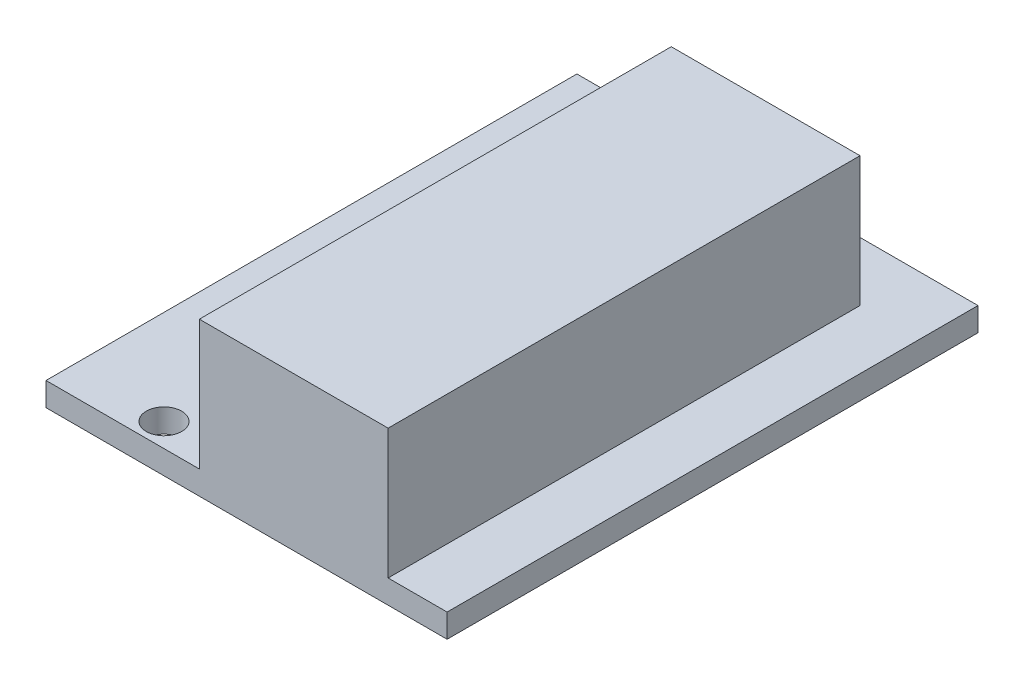
ISO-10303-21;
HEADER;
FILE_DESCRIPTION(('STEP AP214'),'2;1');
FILE_NAME('part.step','',(''),(''),'','','');
FILE_SCHEMA(('AUTOMOTIVE_DESIGN { 1 0 10303 214 1 1 1 1 }'));
ENDSEC;
DATA;
#1=APPLICATION_CONTEXT('core data for automotive mechanical design processes');
#2=APPLICATION_PROTOCOL_DEFINITION('international standard','automotive_design',2000,#1);
#3=PRODUCT_CONTEXT('',#1,'mechanical');
#4=PRODUCT('Part','Part','',(#3));
#5=PRODUCT_RELATED_PRODUCT_CATEGORY('part','',(#4));
#6=PRODUCT_DEFINITION_FORMATION('','',#4);
#7=PRODUCT_DEFINITION_CONTEXT('part definition',#1,'design');
#8=PRODUCT_DEFINITION('design','',#6,#7);
#9=PRODUCT_DEFINITION_SHAPE('','',#8);
#10=(LENGTH_UNIT() NAMED_UNIT(*) SI_UNIT(.MILLI.,.METRE.));
#11=(NAMED_UNIT(*) PLANE_ANGLE_UNIT() SI_UNIT($,.RADIAN.));
#12=(NAMED_UNIT(*) SI_UNIT($,.STERADIAN.) SOLID_ANGLE_UNIT());
#13=UNCERTAINTY_MEASURE_WITH_UNIT(LENGTH_MEASURE(1.E-05),#10,'distance_accuracy_value','');
#14=(GEOMETRIC_REPRESENTATION_CONTEXT(3) GLOBAL_UNCERTAINTY_ASSIGNED_CONTEXT((#13)) GLOBAL_UNIT_ASSIGNED_CONTEXT((#10,
#11,#12)) REPRESENTATION_CONTEXT('',''));
#15=CARTESIAN_POINT('',(0.,0.,0.));
#16=DIRECTION('',(0.,0.,1.));
#17=DIRECTION('',(1.,0.,0.));
#18=AXIS2_PLACEMENT_3D('',#15,#16,#17);
#19=CARTESIAN_POINT('',(12.,13.,-11.));
#20=DIRECTION('',(0.,0.,-1.));
#21=DIRECTION('',(-1.,0.,0.));
#22=AXIS2_PLACEMENT_3D('',#19,#20,#21);
#23=PLANE('',#22);
#24=DIRECTION('',(0.,-1.,0.));
#25=VECTOR('',#24,1.);
#26=CARTESIAN_POINT('',(-4.,13.,-11.));
#27=LINE('',#26,#25);
#28=CARTESIAN_POINT('',(-4.,13.,-11.));
#29=VERTEX_POINT('',#28);
#30=CARTESIAN_POINT('',(-4.,2.,-11.));
#31=VERTEX_POINT('',#30);
#32=EDGE_CURVE('E174',#29,#31,#27,.T.);
#33=ORIENTED_EDGE('',*,*,#32,.T.);
#34=DIRECTION('',(1.,0.,0.));
#35=VECTOR('',#34,1.);
#36=CARTESIAN_POINT('',(0.,2.,-11.));
#37=LINE('',#36,#35);
#38=CARTESIAN_POINT('',(-17.,2.,-11.));
#39=VERTEX_POINT('',#38);
#40=EDGE_CURVE('E43',#39,#31,#37,.T.);
#41=ORIENTED_EDGE('',*,*,#40,.F.);
#42=DIRECTION('',(0.,1.,0.));
#43=VECTOR('',#42,1.);
#44=CARTESIAN_POINT('',(-17.,2.,-11.));
#45=LINE('',#44,#43);
#46=CARTESIAN_POINT('',(-17.,0.,-11.));
#47=VERTEX_POINT('',#46);
#48=EDGE_CURVE('E220',#47,#39,#45,.T.);
#49=ORIENTED_EDGE('',*,*,#48,.F.);
#50=DIRECTION('',(1.,0.,0.));
#51=VECTOR('',#50,1.);
#52=CARTESIAN_POINT('',(0.,0.,-11.));
#53=LINE('',#52,#51);
#54=CARTESIAN_POINT('',(17.,0.,-11.));
#55=VERTEX_POINT('',#54);
#56=EDGE_CURVE('E11',#47,#55,#53,.T.);
#57=ORIENTED_EDGE('',*,*,#56,.T.);
#58=DIRECTION('',(0.,-1.,0.));
#59=VECTOR('',#58,1.);
#60=CARTESIAN_POINT('',(17.,2.,-11.));
#61=LINE('',#60,#59);
#62=CARTESIAN_POINT('',(17.,2.,-11.));
#63=VERTEX_POINT('',#62);
#64=EDGE_CURVE('E57',#63,#55,#61,.T.);
#65=ORIENTED_EDGE('',*,*,#64,.F.);
#66=CARTESIAN_POINT('',(12.,2.,-11.));
#67=VERTEX_POINT('',#66);
#68=EDGE_CURVE('E50',#67,#63,#37,.T.);
#69=ORIENTED_EDGE('',*,*,#68,.F.);
#70=DIRECTION('',(0.,-1.,0.));
#71=VECTOR('',#70,1.);
#72=CARTESIAN_POINT('',(12.,13.,-11.));
#73=LINE('',#72,#71);
#74=CARTESIAN_POINT('',(12.,13.,-11.));
#75=VERTEX_POINT('',#74);
#76=EDGE_CURVE('E165',#75,#67,#73,.T.);
#77=ORIENTED_EDGE('',*,*,#76,.F.);
#78=DIRECTION('',(1.,0.,0.));
#79=VECTOR('',#78,1.);
#80=CARTESIAN_POINT('',(12.,13.,-11.));
#81=LINE('',#80,#79);
#82=EDGE_CURVE('E164',#29,#75,#81,.T.);
#83=ORIENTED_EDGE('',*,*,#82,.F.);
#84=EDGE_LOOP('',(#33,#41,#49,#57,#65,#69,#77,#83));
#85=FACE_BOUND('',#84,.T.);
#86=ADVANCED_FACE('F35',(#85),#23,.F.);
#87=CARTESIAN_POINT('',(-7.00000000000001,10.,-36.));
#88=DIRECTION('',(1.,0.,0.));
#89=DIRECTION('',(0.,0.,-1.));
#90=AXIS2_PLACEMENT_3D('',#87,#88,#89);
#91=PLANE('',#90);
#92=DIRECTION('',(0.,0.,1.));
#93=VECTOR('',#92,1.);
#94=CARTESIAN_POINT('',(-7.00000000000001,2.,-36.));
#95=LINE('',#94,#93);
#96=CARTESIAN_POINT('',(-7.00000000000001,2.,-36.));
#97=VERTEX_POINT('',#96);
#98=CARTESIAN_POINT('',(-7.00000000000001,2.,-16.));
#99=VERTEX_POINT('',#98);
#100=EDGE_CURVE('E145',#97,#99,#95,.T.);
#101=ORIENTED_EDGE('',*,*,#100,.T.);
#102=DIRECTION('',(0.,-1.,0.));
#103=VECTOR('',#102,1.);
#104=CARTESIAN_POINT('',(-7.00000000000001,10.,-16.));
#105=LINE('',#104,#103);
#106=CARTESIAN_POINT('',(-7.00000000000001,10.,-16.));
#107=VERTEX_POINT('',#106);
#108=EDGE_CURVE('E126',#107,#99,#105,.T.);
#109=ORIENTED_EDGE('',*,*,#108,.F.);
#110=DIRECTION('',(0.,0.,1.));
#111=VECTOR('',#110,1.);
#112=CARTESIAN_POINT('',(-7.00000000000001,10.,-36.));
#113=LINE('',#112,#111);
#114=CARTESIAN_POINT('',(-7.00000000000001,10.,-36.));
#115=VERTEX_POINT('',#114);
#116=EDGE_CURVE('E133',#115,#107,#113,.T.);
#117=ORIENTED_EDGE('',*,*,#116,.F.);
#118=DIRECTION('',(0.,-1.,0.));
#119=VECTOR('',#118,1.);
#120=CARTESIAN_POINT('',(-7.00000000000001,10.,-36.));
#121=LINE('',#120,#119);
#122=EDGE_CURVE('E148',#115,#97,#121,.T.);
#123=ORIENTED_EDGE('',*,*,#122,.T.);
#124=EDGE_LOOP('',(#101,#109,#117,#123));
#125=FACE_BOUND('',#124,.T.);
#126=ADVANCED_FACE('F143',(#125),#91,.F.);
#127=CARTESIAN_POINT('',(-9.00000000000001,2.,-13.));
#128=DIRECTION('',(0.,-1.,0.));
#129=DIRECTION('',(0.,0.,-1.));
#130=AXIS2_PLACEMENT_3D('',#127,#128,#129);
#131=CYLINDRICAL_SURFACE('',#130,1.5);
#132=CARTESIAN_POINT('',(-9.00000000000001,2.,-13.));
#133=DIRECTION('',(0.,1.,0.));
#134=DIRECTION('',(0.,0.,1.));
#135=AXIS2_PLACEMENT_3D('',#132,#133,#134);
#136=CIRCLE('',#135,1.5);
#137=CARTESIAN_POINT('',(-9.00000000000001,2.,-11.5));
#138=VERTEX_POINT('',#137);
#139=EDGE_CURVE('E184',#138,#138,#136,.T.);
#140=ORIENTED_EDGE('',*,*,#139,.T.);
#141=EDGE_LOOP('',(#140));
#142=FACE_BOUND('',#141,.T.);
#143=CARTESIAN_POINT('',(-9.00000000000001,0.,-13.));
#144=DIRECTION('',(0.,1.,0.));
#145=DIRECTION('',(0.,0.,1.));
#146=AXIS2_PLACEMENT_3D('',#143,#144,#145);
#147=CIRCLE('',#146,1.5);
#148=CARTESIAN_POINT('',(-9.00000000000001,0.,-11.5));
#149=VERTEX_POINT('',#148);
#150=EDGE_CURVE('E183',#149,#149,#147,.T.);
#151=ORIENTED_EDGE('',*,*,#150,.F.);
#152=EDGE_LOOP('',(#151));
#153=FACE_BOUND('',#152,.T.);
#154=ADVANCED_FACE('F266',(#142,#153),#131,.F.);
#155=CARTESIAN_POINT('',(-9.00000000000001,2.,-49.));
#156=DIRECTION('',(0.,-1.,0.));
#157=DIRECTION('',(0.,0.,-1.));
#158=AXIS2_PLACEMENT_3D('',#155,#156,#157);
#159=CYLINDRICAL_SURFACE('',#158,1.5);
#160=CARTESIAN_POINT('',(-9.00000000000001,2.,-49.));
#161=DIRECTION('',(0.,1.,0.));
#162=DIRECTION('',(0.,0.,1.));
#163=AXIS2_PLACEMENT_3D('',#160,#161,#162);
#164=CIRCLE('',#163,1.5);
#165=CARTESIAN_POINT('',(-9.00000000000001,2.,-47.5));
#166=VERTEX_POINT('',#165);
#167=EDGE_CURVE('E190',#166,#166,#164,.T.);
#168=ORIENTED_EDGE('',*,*,#167,.T.);
#169=EDGE_LOOP('',(#168));
#170=FACE_BOUND('',#169,.T.);
#171=CARTESIAN_POINT('',(-9.00000000000001,0.,-49.));
#172=DIRECTION('',(0.,1.,0.));
#173=DIRECTION('',(0.,0.,1.));
#174=AXIS2_PLACEMENT_3D('',#171,#172,#173);
#175=CIRCLE('',#174,1.5);
#176=CARTESIAN_POINT('',(-9.00000000000001,0.,-47.5));
#177=VERTEX_POINT('',#176);
#178=EDGE_CURVE('E187',#177,#177,#175,.T.);
#179=ORIENTED_EDGE('',*,*,#178,.F.);
#180=EDGE_LOOP('',(#179));
#181=FACE_BOUND('',#180,.T.);
#182=ADVANCED_FACE('F294',(#170,#181),#159,.F.);
#183=CARTESIAN_POINT('',(-17.,2.,-56.));
#184=DIRECTION('',(0.,0.,1.));
#185=DIRECTION('',(1.,0.,0.));
#186=AXIS2_PLACEMENT_3D('',#183,#184,#185);
#187=PLANE('',#186);
#188=DIRECTION('',(-1.,0.,0.));
#189=VECTOR('',#188,1.);
#190=CARTESIAN_POINT('',(-17.,0.,-56.));
#191=LINE('',#190,#189);
#192=CARTESIAN_POINT('',(17.,0.,-56.));
#193=VERTEX_POINT('',#192);
#194=CARTESIAN_POINT('',(-17.,0.,-56.));
#195=VERTEX_POINT('',#194);
#196=EDGE_CURVE('E206',#193,#195,#191,.T.);
#197=ORIENTED_EDGE('',*,*,#196,.T.);
#198=DIRECTION('',(0.,-1.,0.));
#199=VECTOR('',#198,1.);
#200=CARTESIAN_POINT('',(-17.,2.,-56.));
#201=LINE('',#200,#199);
#202=CARTESIAN_POINT('',(-17.,2.,-56.));
#203=VERTEX_POINT('',#202);
#204=EDGE_CURVE('E204',#203,#195,#201,.T.);
#205=ORIENTED_EDGE('',*,*,#204,.F.);
#206=DIRECTION('',(-1.,0.,0.));
#207=VECTOR('',#206,1.);
#208=CARTESIAN_POINT('',(-17.,2.,-56.));
#209=LINE('',#208,#207);
#210=CARTESIAN_POINT('',(17.,2.,-56.));
#211=VERTEX_POINT('',#210);
#212=EDGE_CURVE('E198',#211,#203,#209,.T.);
#213=ORIENTED_EDGE('',*,*,#212,.F.);
#214=DIRECTION('',(0.,-1.,0.));
#215=VECTOR('',#214,1.);
#216=CARTESIAN_POINT('',(17.,2.,-56.));
#217=LINE('',#216,#215);
#218=EDGE_CURVE('E212',#211,#193,#217,.T.);
#219=ORIENTED_EDGE('',*,*,#218,.T.);
#220=EDGE_LOOP('',(#197,#205,#213,#219));
#221=FACE_BOUND('',#220,.T.);
#222=ADVANCED_FACE('F258',(#221),#187,.F.);
#223=CARTESIAN_POINT('',(0.,10.,0.));
#224=DIRECTION('',(0.,1.,0.));
#225=DIRECTION('',(0.,0.,1.));
#226=AXIS2_PLACEMENT_3D('',#223,#224,#225);
#227=PLANE('',#226);
#228=DIRECTION('',(0.,0.,1.));
#229=VECTOR('',#228,1.);
#230=CARTESIAN_POINT('',(-4.00000000000001,10.,-51.));
#231=LINE('',#230,#229);
#232=CARTESIAN_POINT('',(-4.,10.,-36.));
#233=VERTEX_POINT('',#232);
#234=CARTESIAN_POINT('',(-4.,10.,-16.));
#235=VERTEX_POINT('',#234);
#236=EDGE_CURVE('E215',#233,#235,#231,.T.);
#237=ORIENTED_EDGE('',*,*,#236,.F.);
#238=DIRECTION('',(-1.,0.,0.));
#239=VECTOR('',#238,1.);
#240=CARTESIAN_POINT('',(-7.00000000000001,10.,-36.));
#241=LINE('',#240,#239);
#242=EDGE_CURVE('E132',#233,#115,#241,.T.);
#243=ORIENTED_EDGE('',*,*,#242,.T.);
#244=ORIENTED_EDGE('',*,*,#116,.T.);
#245=DIRECTION('',(1.,0.,0.));
#246=VECTOR('',#245,1.);
#247=CARTESIAN_POINT('',(-7.00000000000001,10.,-16.));
#248=LINE('',#247,#246);
#249=EDGE_CURVE('E122',#107,#235,#248,.T.);
#250=ORIENTED_EDGE('',*,*,#249,.T.);
#251=EDGE_LOOP('',(#237,#243,#244,#250));
#252=FACE_BOUND('',#251,.T.);
#253=ADVANCED_FACE('F136',(#252),#227,.T.);
#254=CARTESIAN_POINT('',(-7.00000000000001,10.,-36.));
#255=DIRECTION('',(0.,0.,1.));
#256=DIRECTION('',(1.,0.,0.));
#257=AXIS2_PLACEMENT_3D('',#254,#255,#256);
#258=PLANE('',#257);
#259=ORIENTED_EDGE('',*,*,#242,.F.);
#260=DIRECTION('',(0.,-1.,0.));
#261=VECTOR('',#260,1.);
#262=CARTESIAN_POINT('',(-4.00000000000001,13.,-36.));
#263=LINE('',#262,#261);
#264=CARTESIAN_POINT('',(-4.,2.,-36.));
#265=VERTEX_POINT('',#264);
#266=EDGE_CURVE('E217',#233,#265,#263,.T.);
#267=ORIENTED_EDGE('',*,*,#266,.T.);
#268=DIRECTION('',(-1.,0.,0.));
#269=VECTOR('',#268,1.);
#270=CARTESIAN_POINT('',(-7.00000000000001,2.,-36.));
#271=LINE('',#270,#269);
#272=EDGE_CURVE('E141',#265,#97,#271,.T.);
#273=ORIENTED_EDGE('',*,*,#272,.T.);
#274=ORIENTED_EDGE('',*,*,#122,.F.);
#275=EDGE_LOOP('',(#259,#267,#273,#274));
#276=FACE_BOUND('',#275,.T.);
#277=ADVANCED_FACE('F249',(#276),#258,.F.);
#278=CARTESIAN_POINT('',(0.,2.,0.));
#279=DIRECTION('',(0.,-1.,0.));
#280=DIRECTION('',(0.,0.,-1.));
#281=AXIS2_PLACEMENT_3D('',#278,#279,#280);
#282=PLANE('',#281);
#283=ORIENTED_EDGE('',*,*,#139,.F.);
#284=EDGE_LOOP('',(#283));
#285=FACE_BOUND('',#284,.T.);
#286=ORIENTED_EDGE('',*,*,#167,.F.);
#287=EDGE_LOOP('',(#286));
#288=FACE_BOUND('',#287,.T.);
#289=DIRECTION('',(0.,0.,1.));
#290=VECTOR('',#289,1.);
#291=CARTESIAN_POINT('',(-17.,2.,56.));
#292=LINE('',#291,#290);
#293=EDGE_CURVE('E201',#203,#39,#292,.T.);
#294=ORIENTED_EDGE('',*,*,#293,.T.);
#295=ORIENTED_EDGE('',*,*,#40,.T.);
#296=DIRECTION('',(0.,0.,1.));
#297=VECTOR('',#296,1.);
#298=CARTESIAN_POINT('',(-4.00000000000001,2.,-51.));
#299=LINE('',#298,#297);
#300=CARTESIAN_POINT('',(-4.,2.,-16.));
#301=VERTEX_POINT('',#300);
#302=EDGE_CURVE('E169',#301,#31,#299,.T.);
#303=ORIENTED_EDGE('',*,*,#302,.F.);
#304=DIRECTION('',(1.,0.,0.));
#305=VECTOR('',#304,1.);
#306=CARTESIAN_POINT('',(-7.00000000000001,2.,-16.));
#307=LINE('',#306,#305);
#308=EDGE_CURVE('E245',#99,#301,#307,.T.);
#309=ORIENTED_EDGE('',*,*,#308,.F.);
#310=ORIENTED_EDGE('',*,*,#100,.F.);
#311=ORIENTED_EDGE('',*,*,#272,.F.);
#312=CARTESIAN_POINT('',(-4.00000000000001,2.,-51.));
#313=VERTEX_POINT('',#312);
#314=EDGE_CURVE('E160',#313,#265,#299,.T.);
#315=ORIENTED_EDGE('',*,*,#314,.F.);
#316=DIRECTION('',(-1.,0.,0.));
#317=VECTOR('',#316,1.);
#318=CARTESIAN_POINT('',(12.,2.,-51.));
#319=LINE('',#318,#317);
#320=CARTESIAN_POINT('',(12.,2.,-51.));
#321=VERTEX_POINT('',#320);
#322=EDGE_CURVE('E151',#321,#313,#319,.T.);
#323=ORIENTED_EDGE('',*,*,#322,.F.);
#324=DIRECTION('',(0.,0.,-1.));
#325=VECTOR('',#324,1.);
#326=CARTESIAN_POINT('',(12.,2.,-51.));
#327=LINE('',#326,#325);
#328=EDGE_CURVE('E147',#67,#321,#327,.T.);
#329=ORIENTED_EDGE('',*,*,#328,.F.);
#330=ORIENTED_EDGE('',*,*,#68,.T.);
#331=DIRECTION('',(0.,0.,-1.));
#332=VECTOR('',#331,1.);
#333=CARTESIAN_POINT('',(17.,2.,56.));
#334=LINE('',#333,#332);
#335=EDGE_CURVE('E196',#63,#211,#334,.T.);
#336=ORIENTED_EDGE('',*,*,#335,.T.);
#337=ORIENTED_EDGE('',*,*,#212,.T.);
#338=EDGE_LOOP('',(#294,#295,#303,#309,#310,#311,#315,#323,#329,#330,#336,#337));
#339=FACE_BOUND('',#338,.T.);
#340=ADVANCED_FACE('F225',(#285,#288,#339),#282,.F.);
#341=CARTESIAN_POINT('',(-7.00000000000001,10.,-16.));
#342=DIRECTION('',(0.,0.,-1.));
#343=DIRECTION('',(-1.,0.,0.));
#344=AXIS2_PLACEMENT_3D('',#341,#342,#343);
#345=PLANE('',#344);
#346=ORIENTED_EDGE('',*,*,#308,.T.);
#347=DIRECTION('',(0.,1.,0.));
#348=VECTOR('',#347,1.);
#349=CARTESIAN_POINT('',(-4.,13.,-16.));
#350=LINE('',#349,#348);
#351=EDGE_CURVE('E129',#301,#235,#350,.T.);
#352=ORIENTED_EDGE('',*,*,#351,.T.);
#353=ORIENTED_EDGE('',*,*,#249,.F.);
#354=ORIENTED_EDGE('',*,*,#108,.T.);
#355=EDGE_LOOP('',(#346,#352,#353,#354));
#356=FACE_BOUND('',#355,.T.);
#357=ADVANCED_FACE('F124',(#356),#345,.F.);
#358=CARTESIAN_POINT('',(-4.00000000000001,13.,-51.));
#359=DIRECTION('',(1.,0.,0.));
#360=DIRECTION('',(0.,0.,-1.));
#361=AXIS2_PLACEMENT_3D('',#358,#359,#360);
#362=PLANE('',#361);
#363=ORIENTED_EDGE('',*,*,#351,.F.);
#364=ORIENTED_EDGE('',*,*,#302,.T.);
#365=ORIENTED_EDGE('',*,*,#32,.F.);
#366=DIRECTION('',(0.,0.,1.));
#367=VECTOR('',#366,1.);
#368=CARTESIAN_POINT('',(-4.00000000000001,13.,-51.));
#369=LINE('',#368,#367);
#370=CARTESIAN_POINT('',(-4.00000000000001,13.,-51.));
#371=VERTEX_POINT('',#370);
#372=EDGE_CURVE('E162',#371,#29,#369,.T.);
#373=ORIENTED_EDGE('',*,*,#372,.F.);
#374=DIRECTION('',(0.,-1.,0.));
#375=VECTOR('',#374,1.);
#376=CARTESIAN_POINT('',(-4.00000000000001,13.,-51.));
#377=LINE('',#376,#375);
#378=EDGE_CURVE('E177',#371,#313,#377,.T.);
#379=ORIENTED_EDGE('',*,*,#378,.T.);
#380=ORIENTED_EDGE('',*,*,#314,.T.);
#381=ORIENTED_EDGE('',*,*,#266,.F.);
#382=ORIENTED_EDGE('',*,*,#236,.T.);
#383=EDGE_LOOP('',(#363,#364,#365,#373,#379,#380,#381,#382));
#384=FACE_BOUND('',#383,.T.);
#385=ADVANCED_FACE('F231',(#384),#362,.F.);
#386=CARTESIAN_POINT('',(12.,13.,-51.));
#387=DIRECTION('',(0.,0.,1.));
#388=DIRECTION('',(1.,0.,0.));
#389=AXIS2_PLACEMENT_3D('',#386,#387,#388);
#390=PLANE('',#389);
#391=ORIENTED_EDGE('',*,*,#322,.T.);
#392=ORIENTED_EDGE('',*,*,#378,.F.);
#393=DIRECTION('',(-1.,0.,0.));
#394=VECTOR('',#393,1.);
#395=CARTESIAN_POINT('',(12.,13.,-51.));
#396=LINE('',#395,#394);
#397=CARTESIAN_POINT('',(12.,13.,-51.));
#398=VERTEX_POINT('',#397);
#399=EDGE_CURVE('E159',#398,#371,#396,.T.);
#400=ORIENTED_EDGE('',*,*,#399,.F.);
#401=DIRECTION('',(0.,-1.,0.));
#402=VECTOR('',#401,1.);
#403=CARTESIAN_POINT('',(12.,13.,-51.));
#404=LINE('',#403,#402);
#405=EDGE_CURVE('E180',#398,#321,#404,.T.);
#406=ORIENTED_EDGE('',*,*,#405,.T.);
#407=EDGE_LOOP('',(#391,#392,#400,#406));
#408=FACE_BOUND('',#407,.T.);
#409=ADVANCED_FACE('F242',(#408),#390,.F.);
#410=CARTESIAN_POINT('',(12.,13.,-51.));
#411=DIRECTION('',(-1.,0.,0.));
#412=DIRECTION('',(0.,0.,1.));
#413=AXIS2_PLACEMENT_3D('',#410,#411,#412);
#414=PLANE('',#413);
#415=ORIENTED_EDGE('',*,*,#328,.T.);
#416=ORIENTED_EDGE('',*,*,#405,.F.);
#417=DIRECTION('',(0.,0.,-1.));
#418=VECTOR('',#417,1.);
#419=CARTESIAN_POINT('',(12.,13.,-51.));
#420=LINE('',#419,#418);
#421=EDGE_CURVE('E156',#75,#398,#420,.T.);
#422=ORIENTED_EDGE('',*,*,#421,.F.);
#423=ORIENTED_EDGE('',*,*,#76,.T.);
#424=EDGE_LOOP('',(#415,#416,#422,#423));
#425=FACE_BOUND('',#424,.T.);
#426=ADVANCED_FACE('F303',(#425),#414,.F.);
#427=CARTESIAN_POINT('',(0.,13.,0.));
#428=DIRECTION('',(0.,-1.,0.));
#429=DIRECTION('',(0.,0.,-1.));
#430=AXIS2_PLACEMENT_3D('',#427,#428,#429);
#431=PLANE('',#430);
#432=ORIENTED_EDGE('',*,*,#421,.T.);
#433=ORIENTED_EDGE('',*,*,#399,.T.);
#434=ORIENTED_EDGE('',*,*,#372,.T.);
#435=ORIENTED_EDGE('',*,*,#82,.T.);
#436=EDGE_LOOP('',(#432,#433,#434,#435));
#437=FACE_BOUND('',#436,.T.);
#438=ADVANCED_FACE('F237',(#437),#431,.F.);
#439=CARTESIAN_POINT('',(0.,0.,0.));
#440=DIRECTION('',(0.,-1.,0.));
#441=DIRECTION('',(0.,0.,-1.));
#442=AXIS2_PLACEMENT_3D('',#439,#440,#441);
#443=PLANE('',#442);
#444=ORIENTED_EDGE('',*,*,#56,.F.);
#445=DIRECTION('',(0.,0.,1.));
#446=VECTOR('',#445,1.);
#447=CARTESIAN_POINT('',(-17.,0.,56.));
#448=LINE('',#447,#446);
#449=EDGE_CURVE('E199',#195,#47,#448,.T.);
#450=ORIENTED_EDGE('',*,*,#449,.F.);
#451=ORIENTED_EDGE('',*,*,#196,.F.);
#452=DIRECTION('',(0.,0.,-1.));
#453=VECTOR('',#452,1.);
#454=CARTESIAN_POINT('',(17.,0.,56.));
#455=LINE('',#454,#453);
#456=EDGE_CURVE('E193',#55,#193,#455,.T.);
#457=ORIENTED_EDGE('',*,*,#456,.F.);
#458=EDGE_LOOP('',(#444,#450,#451,#457));
#459=FACE_BOUND('',#458,.T.);
#460=ORIENTED_EDGE('',*,*,#178,.T.);
#461=EDGE_LOOP('',(#460));
#462=FACE_BOUND('',#461,.T.);
#463=ORIENTED_EDGE('',*,*,#150,.T.);
#464=EDGE_LOOP('',(#463));
#465=FACE_BOUND('',#464,.T.);
#466=ADVANCED_FACE('F275',(#459,#462,#465),#443,.T.);
#467=CARTESIAN_POINT('',(-17.,2.,56.));
#468=DIRECTION('',(1.,0.,0.));
#469=DIRECTION('',(0.,0.,-1.));
#470=AXIS2_PLACEMENT_3D('',#467,#468,#469);
#471=PLANE('',#470);
#472=ORIENTED_EDGE('',*,*,#449,.T.);
#473=ORIENTED_EDGE('',*,*,#48,.T.);
#474=ORIENTED_EDGE('',*,*,#293,.F.);
#475=ORIENTED_EDGE('',*,*,#204,.T.);
#476=EDGE_LOOP('',(#472,#473,#474,#475));
#477=FACE_BOUND('',#476,.T.);
#478=ADVANCED_FACE('F271',(#477),#471,.F.);
#479=CARTESIAN_POINT('',(17.,2.,56.));
#480=DIRECTION('',(-1.,0.,0.));
#481=DIRECTION('',(0.,0.,1.));
#482=AXIS2_PLACEMENT_3D('',#479,#480,#481);
#483=PLANE('',#482);
#484=ORIENTED_EDGE('',*,*,#335,.F.);
#485=ORIENTED_EDGE('',*,*,#64,.T.);
#486=ORIENTED_EDGE('',*,*,#456,.T.);
#487=ORIENTED_EDGE('',*,*,#218,.F.);
#488=EDGE_LOOP('',(#484,#485,#486,#487));
#489=FACE_BOUND('',#488,.T.);
#490=ADVANCED_FACE('F37',(#489),#483,.F.);
#491=CLOSED_SHELL('',(#86,#126,#154,#182,#222,#253,#277,#340,#357,#385,#409,#426,#438,#466,#478,#490));
#492=MANIFOLD_SOLID_BREP('B2',#491);
#493=ADVANCED_BREP_SHAPE_REPRESENTATION('',(#18,#492),#14);
#494=SHAPE_DEFINITION_REPRESENTATION(#9,#493);
ENDSEC;
END-ISO-10303-21;
